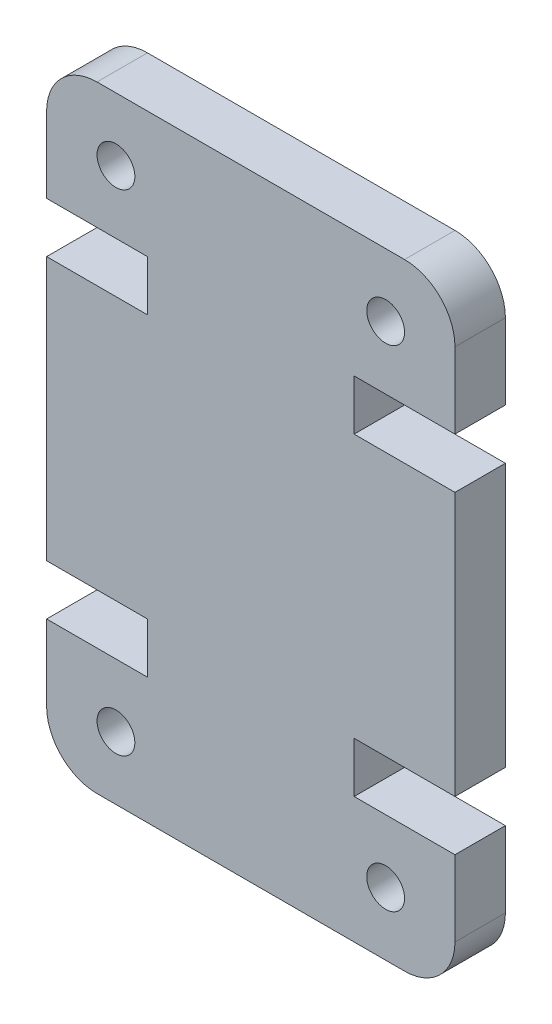
ISO-10303-21;
HEADER;
FILE_DESCRIPTION(('STEP AP214'),'2;1');
FILE_NAME('part.step','',(''),(''),'','','');
FILE_SCHEMA(('AUTOMOTIVE_DESIGN { 1 0 10303 214 1 1 1 1 }'));
ENDSEC;
DATA;
#1=APPLICATION_CONTEXT('core data for automotive mechanical design processes');
#2=APPLICATION_PROTOCOL_DEFINITION('international standard','automotive_design',2000,#1);
#3=PRODUCT_CONTEXT('',#1,'mechanical');
#4=PRODUCT('Part','Part','',(#3));
#5=PRODUCT_RELATED_PRODUCT_CATEGORY('part','',(#4));
#6=PRODUCT_DEFINITION_FORMATION('','',#4);
#7=PRODUCT_DEFINITION_CONTEXT('part definition',#1,'design');
#8=PRODUCT_DEFINITION('design','',#6,#7);
#9=PRODUCT_DEFINITION_SHAPE('','',#8);
#10=(LENGTH_UNIT() NAMED_UNIT(*) SI_UNIT(.MILLI.,.METRE.));
#11=(NAMED_UNIT(*) PLANE_ANGLE_UNIT() SI_UNIT($,.RADIAN.));
#12=(NAMED_UNIT(*) SI_UNIT($,.STERADIAN.) SOLID_ANGLE_UNIT());
#13=UNCERTAINTY_MEASURE_WITH_UNIT(LENGTH_MEASURE(1.E-05),#10,'distance_accuracy_value','');
#14=(GEOMETRIC_REPRESENTATION_CONTEXT(3) GLOBAL_UNCERTAINTY_ASSIGNED_CONTEXT((#13)) GLOBAL_UNIT_ASSIGNED_CONTEXT((#10,
#11,#12)) REPRESENTATION_CONTEXT('',''));
#15=CARTESIAN_POINT('',(0.,0.,0.));
#16=DIRECTION('',(0.,0.,1.));
#17=DIRECTION('',(1.,0.,0.));
#18=AXIS2_PLACEMENT_3D('',#15,#16,#17);
#19=CARTESIAN_POINT('',(14.2,2.,2.));
#20=DIRECTION('',(0.,0.,-1.));
#21=DIRECTION('',(-1.,0.,0.));
#22=AXIS2_PLACEMENT_3D('',#19,#20,#21);
#23=PLANE('',#22);
#24=CARTESIAN_POINT('',(2.74999999999805,21.9500000000001,2.));
#25=DIRECTION('',(0.,0.,1.));
#26=DIRECTION('',(-1.,0.,0.));
#27=AXIS2_PLACEMENT_3D('',#24,#25,#26);
#28=CIRCLE('',#27,0.750000000000028);
#29=CARTESIAN_POINT('',(1.99999999999802,21.9500000000001,2.));
#30=VERTEX_POINT('',#29);
#31=EDGE_CURVE('E448',#30,#30,#28,.T.);
#32=ORIENTED_EDGE('',*,*,#31,.F.);
#33=EDGE_LOOP('',(#32));
#34=FACE_BOUND('',#33,.T.);
#35=CARTESIAN_POINT('',(13.4500000000019,2.4999999999999,2.));
#36=DIRECTION('',(0.,0.,1.));
#37=DIRECTION('',(-1.,0.,0.));
#38=AXIS2_PLACEMENT_3D('',#35,#36,#37);
#39=CIRCLE('',#38,0.750000000000029);
#40=CARTESIAN_POINT('',(12.7000000000019,2.4999999999999,2.));
#41=VERTEX_POINT('',#40);
#42=EDGE_CURVE('E230',#41,#41,#39,.T.);
#43=ORIENTED_EDGE('',*,*,#42,.F.);
#44=EDGE_LOOP('',(#43));
#45=FACE_BOUND('',#44,.T.);
#46=CARTESIAN_POINT('',(14.2,2.,2.));
#47=DIRECTION('',(0.,0.,1.));
#48=DIRECTION('',(-1.,0.,0.));
#49=AXIS2_PLACEMENT_3D('',#46,#47,#48);
#50=CIRCLE('',#49,2.);
#51=CARTESIAN_POINT('',(14.2,0.,2.));
#52=VERTEX_POINT('',#51);
#53=CARTESIAN_POINT('',(16.2,2.,2.));
#54=VERTEX_POINT('',#53);
#55=EDGE_CURVE('E273',#52,#54,#50,.T.);
#56=ORIENTED_EDGE('',*,*,#55,.T.);
#57=DIRECTION('',(0.,1.,0.));
#58=VECTOR('',#57,1.);
#59=CARTESIAN_POINT('',(16.2,5.00000000000014,2.));
#60=LINE('',#59,#58);
#61=CARTESIAN_POINT('',(16.2,5.00000000000014,2.));
#62=VERTEX_POINT('',#61);
#63=EDGE_CURVE('E141',#54,#62,#60,.T.);
#64=ORIENTED_EDGE('',*,*,#63,.T.);
#65=DIRECTION('',(-1.,0.,0.));
#66=VECTOR('',#65,1.);
#67=CARTESIAN_POINT('',(12.2,5.00000000000014,2.));
#68=LINE('',#67,#66);
#69=CARTESIAN_POINT('',(12.2,5.00000000000014,2.));
#70=VERTEX_POINT('',#69);
#71=EDGE_CURVE('E336',#62,#70,#68,.T.);
#72=ORIENTED_EDGE('',*,*,#71,.T.);
#73=DIRECTION('',(0.,1.,0.));
#74=VECTOR('',#73,1.);
#75=CARTESIAN_POINT('',(12.2,7.00000000000014,2.));
#76=LINE('',#75,#74);
#77=CARTESIAN_POINT('',(12.2,7.00000000000014,2.));
#78=VERTEX_POINT('',#77);
#79=EDGE_CURVE('E355',#70,#78,#76,.T.);
#80=ORIENTED_EDGE('',*,*,#79,.T.);
#81=DIRECTION('',(1.,0.,0.));
#82=VECTOR('',#81,1.);
#83=CARTESIAN_POINT('',(16.2,7.00000000000014,2.));
#84=LINE('',#83,#82);
#85=CARTESIAN_POINT('',(16.2,7.00000000000014,2.));
#86=VERTEX_POINT('',#85);
#87=EDGE_CURVE('E352',#78,#86,#84,.T.);
#88=ORIENTED_EDGE('',*,*,#87,.T.);
#89=DIRECTION('',(0.,1.,0.));
#90=VECTOR('',#89,1.);
#91=CARTESIAN_POINT('',(16.2,17.4499999999999,2.));
#92=LINE('',#91,#90);
#93=CARTESIAN_POINT('',(16.2,17.4499999999999,2.));
#94=VERTEX_POINT('',#93);
#95=EDGE_CURVE('E354',#86,#94,#92,.T.);
#96=ORIENTED_EDGE('',*,*,#95,.T.);
#97=DIRECTION('',(-1.,0.,0.));
#98=VECTOR('',#97,1.);
#99=CARTESIAN_POINT('',(16.2,17.4499999999999,2.));
#100=LINE('',#99,#98);
#101=CARTESIAN_POINT('',(12.2,17.4499999999999,2.));
#102=VERTEX_POINT('',#101);
#103=EDGE_CURVE('E357',#94,#102,#100,.T.);
#104=ORIENTED_EDGE('',*,*,#103,.T.);
#105=DIRECTION('',(0.,1.,0.));
#106=VECTOR('',#105,1.);
#107=CARTESIAN_POINT('',(12.2,17.4499999999999,2.));
#108=LINE('',#107,#106);
#109=CARTESIAN_POINT('',(12.2,19.4499999999999,2.));
#110=VERTEX_POINT('',#109);
#111=EDGE_CURVE('E363',#102,#110,#108,.T.);
#112=ORIENTED_EDGE('',*,*,#111,.T.);
#113=DIRECTION('',(1.,0.,0.));
#114=VECTOR('',#113,1.);
#115=CARTESIAN_POINT('',(12.2,19.4499999999999,2.));
#116=LINE('',#115,#114);
#117=CARTESIAN_POINT('',(16.2,19.4499999999999,2.));
#118=VERTEX_POINT('',#117);
#119=EDGE_CURVE('E365',#110,#118,#116,.T.);
#120=ORIENTED_EDGE('',*,*,#119,.T.);
#121=DIRECTION('',(0.,1.,0.));
#122=VECTOR('',#121,1.);
#123=CARTESIAN_POINT('',(16.2,19.4499999999999,2.));
#124=LINE('',#123,#122);
#125=CARTESIAN_POINT('',(16.2,22.45,2.));
#126=VERTEX_POINT('',#125);
#127=EDGE_CURVE('E367',#118,#126,#124,.T.);
#128=ORIENTED_EDGE('',*,*,#127,.T.);
#129=CARTESIAN_POINT('',(14.2,22.45,2.));
#130=DIRECTION('',(0.,0.,1.));
#131=DIRECTION('',(1.,0.,0.));
#132=AXIS2_PLACEMENT_3D('',#129,#130,#131);
#133=CIRCLE('',#132,2.);
#134=CARTESIAN_POINT('',(14.2,24.45,2.));
#135=VERTEX_POINT('',#134);
#136=EDGE_CURVE('E369',#126,#135,#133,.T.);
#137=ORIENTED_EDGE('',*,*,#136,.T.);
#138=DIRECTION('',(-1.,0.,0.));
#139=VECTOR('',#138,1.);
#140=CARTESIAN_POINT('',(1.99999999999999,24.45,2.));
#141=LINE('',#140,#139);
#142=CARTESIAN_POINT('',(1.99999999999999,24.45,2.));
#143=VERTEX_POINT('',#142);
#144=EDGE_CURVE('E371',#135,#143,#141,.T.);
#145=ORIENTED_EDGE('',*,*,#144,.T.);
#146=CARTESIAN_POINT('',(2.,22.45,2.));
#147=DIRECTION('',(0.,0.,1.));
#148=DIRECTION('',(-1.,0.,0.));
#149=AXIS2_PLACEMENT_3D('',#146,#147,#148);
#150=CIRCLE('',#149,2.);
#151=CARTESIAN_POINT('',(0.,22.45,2.));
#152=VERTEX_POINT('',#151);
#153=EDGE_CURVE('E373',#143,#152,#150,.T.);
#154=ORIENTED_EDGE('',*,*,#153,.T.);
#155=DIRECTION('',(0.,-1.,0.));
#156=VECTOR('',#155,1.);
#157=CARTESIAN_POINT('',(0.,19.4499999999999,2.));
#158=LINE('',#157,#156);
#159=CARTESIAN_POINT('',(0.,19.4499999999999,2.));
#160=VERTEX_POINT('',#159);
#161=EDGE_CURVE('E375',#152,#160,#158,.T.);
#162=ORIENTED_EDGE('',*,*,#161,.T.);
#163=DIRECTION('',(1.,0.,0.));
#164=VECTOR('',#163,1.);
#165=CARTESIAN_POINT('',(3.99999999999999,19.4499999999999,2.));
#166=LINE('',#165,#164);
#167=CARTESIAN_POINT('',(3.99999999999999,19.4499999999999,2.));
#168=VERTEX_POINT('',#167);
#169=EDGE_CURVE('E377',#160,#168,#166,.T.);
#170=ORIENTED_EDGE('',*,*,#169,.T.);
#171=DIRECTION('',(0.,-1.,0.));
#172=VECTOR('',#171,1.);
#173=CARTESIAN_POINT('',(3.99999999999999,17.4499999999999,2.));
#174=LINE('',#173,#172);
#175=CARTESIAN_POINT('',(3.99999999999999,17.4499999999999,2.));
#176=VERTEX_POINT('',#175);
#177=EDGE_CURVE('E379',#168,#176,#174,.T.);
#178=ORIENTED_EDGE('',*,*,#177,.T.);
#179=DIRECTION('',(-1.,0.,0.));
#180=VECTOR('',#179,1.);
#181=CARTESIAN_POINT('',(0.,17.4499999999999,2.));
#182=LINE('',#181,#180);
#183=CARTESIAN_POINT('',(0.,17.4499999999999,2.));
#184=VERTEX_POINT('',#183);
#185=EDGE_CURVE('E381',#176,#184,#182,.T.);
#186=ORIENTED_EDGE('',*,*,#185,.T.);
#187=DIRECTION('',(0.,-1.,0.));
#188=VECTOR('',#187,1.);
#189=CARTESIAN_POINT('',(0.,17.4499999999999,2.));
#190=LINE('',#189,#188);
#191=CARTESIAN_POINT('',(0.,7.00000000000012,2.));
#192=VERTEX_POINT('',#191);
#193=EDGE_CURVE('E383',#184,#192,#190,.T.);
#194=ORIENTED_EDGE('',*,*,#193,.T.);
#195=DIRECTION('',(1.,0.,0.));
#196=VECTOR('',#195,1.);
#197=CARTESIAN_POINT('',(0.,7.00000000000012,2.));
#198=LINE('',#197,#196);
#199=CARTESIAN_POINT('',(4.,7.00000000000014,2.));
#200=VERTEX_POINT('',#199);
#201=EDGE_CURVE('E385',#192,#200,#198,.T.);
#202=ORIENTED_EDGE('',*,*,#201,.T.);
#203=DIRECTION('',(0.,-1.,0.));
#204=VECTOR('',#203,1.);
#205=CARTESIAN_POINT('',(4.,7.00000000000014,2.));
#206=LINE('',#205,#204);
#207=CARTESIAN_POINT('',(4.,5.00000000000014,2.));
#208=VERTEX_POINT('',#207);
#209=EDGE_CURVE('E387',#200,#208,#206,.T.);
#210=ORIENTED_EDGE('',*,*,#209,.T.);
#211=DIRECTION('',(-1.,0.,0.));
#212=VECTOR('',#211,1.);
#213=CARTESIAN_POINT('',(4.,5.00000000000014,2.));
#214=LINE('',#213,#212);
#215=CARTESIAN_POINT('',(0.,5.00000000000014,2.));
#216=VERTEX_POINT('',#215);
#217=EDGE_CURVE('E208',#208,#216,#214,.T.);
#218=ORIENTED_EDGE('',*,*,#217,.T.);
#219=DIRECTION('',(0.,-1.,0.));
#220=VECTOR('',#219,1.);
#221=CARTESIAN_POINT('',(0.,5.00000000000014,2.));
#222=LINE('',#221,#220);
#223=CARTESIAN_POINT('',(0.,2.00000000000002,2.));
#224=VERTEX_POINT('',#223);
#225=EDGE_CURVE('E202',#216,#224,#222,.T.);
#226=ORIENTED_EDGE('',*,*,#225,.T.);
#227=CARTESIAN_POINT('',(2.,2.,2.));
#228=DIRECTION('',(0.,0.,1.));
#229=DIRECTION('',(1.,0.,0.));
#230=AXIS2_PLACEMENT_3D('',#227,#228,#229);
#231=CIRCLE('',#230,2.);
#232=CARTESIAN_POINT('',(2.,0.,2.));
#233=VERTEX_POINT('',#232);
#234=EDGE_CURVE('E206',#224,#233,#231,.T.);
#235=ORIENTED_EDGE('',*,*,#234,.T.);
#236=DIRECTION('',(1.,0.,0.));
#237=VECTOR('',#236,1.);
#238=CARTESIAN_POINT('',(2.,0.,2.));
#239=LINE('',#238,#237);
#240=EDGE_CURVE('E50',#233,#52,#239,.T.);
#241=ORIENTED_EDGE('',*,*,#240,.T.);
#242=EDGE_LOOP('',(#56,#64,#72,#80,#88,#96,#104,#112,#120,#128,#137,#145,#154,#162,#170,#178,
#186,#194,#202,#210,#218,#226,#235,#241));
#243=FACE_BOUND('',#242,.T.);
#244=CARTESIAN_POINT('',(2.74999999999805,2.4999999999999,2.));
#245=DIRECTION('',(0.,0.,1.));
#246=DIRECTION('',(1.,0.,0.));
#247=AXIS2_PLACEMENT_3D('',#244,#245,#246);
#248=CIRCLE('',#247,0.750000000000028);
#249=CARTESIAN_POINT('',(3.49999999999808,2.4999999999999,2.));
#250=VERTEX_POINT('',#249);
#251=EDGE_CURVE('E454',#250,#250,#248,.T.);
#252=ORIENTED_EDGE('',*,*,#251,.F.);
#253=EDGE_LOOP('',(#252));
#254=FACE_BOUND('',#253,.T.);
#255=CARTESIAN_POINT('',(13.4500000000019,21.9500000000001,2.));
#256=DIRECTION('',(0.,0.,1.));
#257=DIRECTION('',(1.,0.,0.));
#258=AXIS2_PLACEMENT_3D('',#255,#256,#257);
#259=CIRCLE('',#258,0.750000000000024);
#260=CARTESIAN_POINT('',(14.200000000002,21.9500000000001,2.));
#261=VERTEX_POINT('',#260);
#262=EDGE_CURVE('E439',#261,#261,#259,.T.);
#263=ORIENTED_EDGE('',*,*,#262,.F.);
#264=EDGE_LOOP('',(#263));
#265=FACE_BOUND('',#264,.T.);
#266=ADVANCED_FACE('F33',(#34,#45,#243,#254,#265),#23,.F.);
#267=CARTESIAN_POINT('',(14.2,2.,0.));
#268=DIRECTION('',(0.,0.,-1.));
#269=DIRECTION('',(-1.,0.,0.));
#270=AXIS2_PLACEMENT_3D('',#267,#268,#269);
#271=PLANE('',#270);
#272=CARTESIAN_POINT('',(2.74999999999805,21.9500000000001,0.));
#273=DIRECTION('',(0.,0.,1.));
#274=DIRECTION('',(-1.,0.,0.));
#275=AXIS2_PLACEMENT_3D('',#272,#273,#274);
#276=CIRCLE('',#275,0.750000000000028);
#277=CARTESIAN_POINT('',(1.99999999999802,21.9500000000001,0.));
#278=VERTEX_POINT('',#277);
#279=EDGE_CURVE('E445',#278,#278,#276,.T.);
#280=ORIENTED_EDGE('',*,*,#279,.T.);
#281=EDGE_LOOP('',(#280));
#282=FACE_BOUND('',#281,.T.);
#283=CARTESIAN_POINT('',(13.4500000000019,2.4999999999999,0.));
#284=DIRECTION('',(0.,0.,1.));
#285=DIRECTION('',(-1.,0.,0.));
#286=AXIS2_PLACEMENT_3D('',#283,#284,#285);
#287=CIRCLE('',#286,0.750000000000029);
#288=CARTESIAN_POINT('',(12.7000000000019,2.4999999999999,0.));
#289=VERTEX_POINT('',#288);
#290=EDGE_CURVE('E457',#289,#289,#287,.T.);
#291=ORIENTED_EDGE('',*,*,#290,.T.);
#292=EDGE_LOOP('',(#291));
#293=FACE_BOUND('',#292,.T.);
#294=CARTESIAN_POINT('',(14.2,2.,0.));
#295=DIRECTION('',(0.,0.,1.));
#296=DIRECTION('',(-1.,0.,0.));
#297=AXIS2_PLACEMENT_3D('',#294,#295,#296);
#298=CIRCLE('',#297,2.);
#299=CARTESIAN_POINT('',(14.2,0.,0.));
#300=VERTEX_POINT('',#299);
#301=CARTESIAN_POINT('',(16.2,2.,0.));
#302=VERTEX_POINT('',#301);
#303=EDGE_CURVE('E226',#300,#302,#298,.T.);
#304=ORIENTED_EDGE('',*,*,#303,.F.);
#305=DIRECTION('',(1.,0.,0.));
#306=VECTOR('',#305,1.);
#307=CARTESIAN_POINT('',(2.,0.,0.));
#308=LINE('',#307,#306);
#309=CARTESIAN_POINT('',(2.,0.,0.));
#310=VERTEX_POINT('',#309);
#311=EDGE_CURVE('E133',#310,#300,#308,.T.);
#312=ORIENTED_EDGE('',*,*,#311,.F.);
#313=CARTESIAN_POINT('',(2.,2.,0.));
#314=DIRECTION('',(0.,0.,1.));
#315=DIRECTION('',(1.,0.,0.));
#316=AXIS2_PLACEMENT_3D('',#313,#314,#315);
#317=CIRCLE('',#316,2.);
#318=CARTESIAN_POINT('',(0.,2.00000000000002,0.));
#319=VERTEX_POINT('',#318);
#320=EDGE_CURVE('E127',#319,#310,#317,.T.);
#321=ORIENTED_EDGE('',*,*,#320,.F.);
#322=DIRECTION('',(0.,-1.,0.));
#323=VECTOR('',#322,1.);
#324=CARTESIAN_POINT('',(0.,5.00000000000014,0.));
#325=LINE('',#324,#323);
#326=CARTESIAN_POINT('',(0.,5.00000000000014,0.));
#327=VERTEX_POINT('',#326);
#328=EDGE_CURVE('E216',#327,#319,#325,.T.);
#329=ORIENTED_EDGE('',*,*,#328,.F.);
#330=DIRECTION('',(-1.,0.,0.));
#331=VECTOR('',#330,1.);
#332=CARTESIAN_POINT('',(4.,5.00000000000014,0.));
#333=LINE('',#332,#331);
#334=CARTESIAN_POINT('',(4.,5.00000000000014,0.));
#335=VERTEX_POINT('',#334);
#336=EDGE_CURVE('E268',#335,#327,#333,.T.);
#337=ORIENTED_EDGE('',*,*,#336,.F.);
#338=DIRECTION('',(0.,-1.,0.));
#339=VECTOR('',#338,1.);
#340=CARTESIAN_POINT('',(4.,7.00000000000014,0.));
#341=LINE('',#340,#339);
#342=CARTESIAN_POINT('',(4.,7.00000000000014,0.));
#343=VERTEX_POINT('',#342);
#344=EDGE_CURVE('E266',#343,#335,#341,.T.);
#345=ORIENTED_EDGE('',*,*,#344,.F.);
#346=DIRECTION('',(1.,0.,0.));
#347=VECTOR('',#346,1.);
#348=CARTESIAN_POINT('',(0.,7.00000000000012,0.));
#349=LINE('',#348,#347);
#350=CARTESIAN_POINT('',(0.,7.00000000000012,0.));
#351=VERTEX_POINT('',#350);
#352=EDGE_CURVE('E264',#351,#343,#349,.T.);
#353=ORIENTED_EDGE('',*,*,#352,.F.);
#354=DIRECTION('',(0.,-1.,0.));
#355=VECTOR('',#354,1.);
#356=CARTESIAN_POINT('',(0.,17.4499999999999,0.));
#357=LINE('',#356,#355);
#358=CARTESIAN_POINT('',(0.,17.4499999999999,0.));
#359=VERTEX_POINT('',#358);
#360=EDGE_CURVE('E262',#359,#351,#357,.T.);
#361=ORIENTED_EDGE('',*,*,#360,.F.);
#362=DIRECTION('',(-1.,0.,0.));
#363=VECTOR('',#362,1.);
#364=CARTESIAN_POINT('',(0.,17.4499999999999,0.));
#365=LINE('',#364,#363);
#366=CARTESIAN_POINT('',(3.99999999999999,17.4499999999999,0.));
#367=VERTEX_POINT('',#366);
#368=EDGE_CURVE('E260',#367,#359,#365,.T.);
#369=ORIENTED_EDGE('',*,*,#368,.F.);
#370=DIRECTION('',(0.,-1.,0.));
#371=VECTOR('',#370,1.);
#372=CARTESIAN_POINT('',(3.99999999999999,17.4499999999999,0.));
#373=LINE('',#372,#371);
#374=CARTESIAN_POINT('',(3.99999999999999,19.4499999999999,0.));
#375=VERTEX_POINT('',#374);
#376=EDGE_CURVE('E258',#375,#367,#373,.T.);
#377=ORIENTED_EDGE('',*,*,#376,.F.);
#378=DIRECTION('',(1.,0.,0.));
#379=VECTOR('',#378,1.);
#380=CARTESIAN_POINT('',(3.99999999999999,19.4499999999999,0.));
#381=LINE('',#380,#379);
#382=CARTESIAN_POINT('',(0.,19.4499999999999,0.));
#383=VERTEX_POINT('',#382);
#384=EDGE_CURVE('E256',#383,#375,#381,.T.);
#385=ORIENTED_EDGE('',*,*,#384,.F.);
#386=DIRECTION('',(0.,-1.,0.));
#387=VECTOR('',#386,1.);
#388=CARTESIAN_POINT('',(0.,19.4499999999999,0.));
#389=LINE('',#388,#387);
#390=CARTESIAN_POINT('',(0.,22.45,0.));
#391=VERTEX_POINT('',#390);
#392=EDGE_CURVE('E254',#391,#383,#389,.T.);
#393=ORIENTED_EDGE('',*,*,#392,.F.);
#394=CARTESIAN_POINT('',(2.,22.45,0.));
#395=DIRECTION('',(0.,0.,1.));
#396=DIRECTION('',(-1.,0.,0.));
#397=AXIS2_PLACEMENT_3D('',#394,#395,#396);
#398=CIRCLE('',#397,2.);
#399=CARTESIAN_POINT('',(1.99999999999999,24.45,0.));
#400=VERTEX_POINT('',#399);
#401=EDGE_CURVE('E252',#400,#391,#398,.T.);
#402=ORIENTED_EDGE('',*,*,#401,.F.);
#403=DIRECTION('',(-1.,0.,0.));
#404=VECTOR('',#403,1.);
#405=CARTESIAN_POINT('',(1.99999999999999,24.45,0.));
#406=LINE('',#405,#404);
#407=CARTESIAN_POINT('',(14.2,24.45,0.));
#408=VERTEX_POINT('',#407);
#409=EDGE_CURVE('E250',#408,#400,#406,.T.);
#410=ORIENTED_EDGE('',*,*,#409,.F.);
#411=CARTESIAN_POINT('',(14.2,22.45,0.));
#412=DIRECTION('',(0.,0.,1.));
#413=DIRECTION('',(1.,0.,0.));
#414=AXIS2_PLACEMENT_3D('',#411,#412,#413);
#415=CIRCLE('',#414,2.);
#416=CARTESIAN_POINT('',(16.2,22.45,0.));
#417=VERTEX_POINT('',#416);
#418=EDGE_CURVE('E248',#417,#408,#415,.T.);
#419=ORIENTED_EDGE('',*,*,#418,.F.);
#420=DIRECTION('',(0.,1.,0.));
#421=VECTOR('',#420,1.);
#422=CARTESIAN_POINT('',(16.2,19.4499999999999,0.));
#423=LINE('',#422,#421);
#424=CARTESIAN_POINT('',(16.2,19.4499999999999,0.));
#425=VERTEX_POINT('',#424);
#426=EDGE_CURVE('E246',#425,#417,#423,.T.);
#427=ORIENTED_EDGE('',*,*,#426,.F.);
#428=DIRECTION('',(1.,0.,0.));
#429=VECTOR('',#428,1.);
#430=CARTESIAN_POINT('',(12.2,19.4499999999999,0.));
#431=LINE('',#430,#429);
#432=CARTESIAN_POINT('',(12.2,19.4499999999999,0.));
#433=VERTEX_POINT('',#432);
#434=EDGE_CURVE('E244',#433,#425,#431,.T.);
#435=ORIENTED_EDGE('',*,*,#434,.F.);
#436=DIRECTION('',(0.,1.,0.));
#437=VECTOR('',#436,1.);
#438=CARTESIAN_POINT('',(12.2,17.4499999999999,0.));
#439=LINE('',#438,#437);
#440=CARTESIAN_POINT('',(12.2,17.4499999999999,0.));
#441=VERTEX_POINT('',#440);
#442=EDGE_CURVE('E242',#441,#433,#439,.T.);
#443=ORIENTED_EDGE('',*,*,#442,.F.);
#444=DIRECTION('',(-1.,0.,0.));
#445=VECTOR('',#444,1.);
#446=CARTESIAN_POINT('',(16.2,17.4499999999999,0.));
#447=LINE('',#446,#445);
#448=CARTESIAN_POINT('',(16.2,17.4499999999999,0.));
#449=VERTEX_POINT('',#448);
#450=EDGE_CURVE('E240',#449,#441,#447,.T.);
#451=ORIENTED_EDGE('',*,*,#450,.F.);
#452=DIRECTION('',(0.,1.,0.));
#453=VECTOR('',#452,1.);
#454=CARTESIAN_POINT('',(16.2,17.4499999999999,0.));
#455=LINE('',#454,#453);
#456=CARTESIAN_POINT('',(16.2,7.00000000000014,0.));
#457=VERTEX_POINT('',#456);
#458=EDGE_CURVE('E238',#457,#449,#455,.T.);
#459=ORIENTED_EDGE('',*,*,#458,.F.);
#460=DIRECTION('',(1.,0.,0.));
#461=VECTOR('',#460,1.);
#462=CARTESIAN_POINT('',(16.2,7.00000000000014,0.));
#463=LINE('',#462,#461);
#464=CARTESIAN_POINT('',(12.2,7.00000000000014,0.));
#465=VERTEX_POINT('',#464);
#466=EDGE_CURVE('E236',#465,#457,#463,.T.);
#467=ORIENTED_EDGE('',*,*,#466,.F.);
#468=DIRECTION('',(0.,1.,0.));
#469=VECTOR('',#468,1.);
#470=CARTESIAN_POINT('',(12.2,7.00000000000014,0.));
#471=LINE('',#470,#469);
#472=CARTESIAN_POINT('',(12.2,5.00000000000014,0.));
#473=VERTEX_POINT('',#472);
#474=EDGE_CURVE('E234',#473,#465,#471,.T.);
#475=ORIENTED_EDGE('',*,*,#474,.F.);
#476=DIRECTION('',(-1.,0.,0.));
#477=VECTOR('',#476,1.);
#478=CARTESIAN_POINT('',(12.2,5.00000000000014,0.));
#479=LINE('',#478,#477);
#480=CARTESIAN_POINT('',(16.2,5.00000000000014,0.));
#481=VERTEX_POINT('',#480);
#482=EDGE_CURVE('E232',#481,#473,#479,.T.);
#483=ORIENTED_EDGE('',*,*,#482,.F.);
#484=DIRECTION('',(0.,1.,0.));
#485=VECTOR('',#484,1.);
#486=CARTESIAN_POINT('',(16.2,5.00000000000014,0.));
#487=LINE('',#486,#485);
#488=EDGE_CURVE('E229',#302,#481,#487,.T.);
#489=ORIENTED_EDGE('',*,*,#488,.F.);
#490=EDGE_LOOP('',(#304,#312,#321,#329,#337,#345,#353,#361,#369,#377,#385,#393,#402,#410,#419,
#427,#435,#443,#451,#459,#467,#475,#483,#489));
#491=FACE_BOUND('',#490,.T.);
#492=CARTESIAN_POINT('',(2.74999999999805,2.4999999999999,0.));
#493=DIRECTION('',(0.,0.,1.));
#494=DIRECTION('',(1.,0.,0.));
#495=AXIS2_PLACEMENT_3D('',#492,#493,#494);
#496=CIRCLE('',#495,0.750000000000028);
#497=CARTESIAN_POINT('',(3.49999999999808,2.4999999999999,0.));
#498=VERTEX_POINT('',#497);
#499=EDGE_CURVE('E451',#498,#498,#496,.T.);
#500=ORIENTED_EDGE('',*,*,#499,.T.);
#501=EDGE_LOOP('',(#500));
#502=FACE_BOUND('',#501,.T.);
#503=CARTESIAN_POINT('',(13.4500000000019,21.9500000000001,0.));
#504=DIRECTION('',(0.,0.,1.));
#505=DIRECTION('',(1.,0.,0.));
#506=AXIS2_PLACEMENT_3D('',#503,#504,#505);
#507=CIRCLE('',#506,0.750000000000024);
#508=CARTESIAN_POINT('',(14.200000000002,21.9500000000001,0.));
#509=VERTEX_POINT('',#508);
#510=EDGE_CURVE('E442',#509,#509,#507,.T.);
#511=ORIENTED_EDGE('',*,*,#510,.T.);
#512=EDGE_LOOP('',(#511));
#513=FACE_BOUND('',#512,.T.);
#514=ADVANCED_FACE('F340',(#282,#293,#491,#502,#513),#271,.T.);
#515=CARTESIAN_POINT('',(14.2,2.,2.));
#516=DIRECTION('',(0.,0.,-1.));
#517=DIRECTION('',(-1.,0.,0.));
#518=AXIS2_PLACEMENT_3D('',#515,#516,#517);
#519=CYLINDRICAL_SURFACE('',#518,2.);
#520=ORIENTED_EDGE('',*,*,#303,.T.);
#521=DIRECTION('',(0.,0.,-1.));
#522=VECTOR('',#521,1.);
#523=CARTESIAN_POINT('',(16.2,2.,2.));
#524=LINE('',#523,#522);
#525=EDGE_CURVE('E11',#54,#302,#524,.T.);
#526=ORIENTED_EDGE('',*,*,#525,.F.);
#527=ORIENTED_EDGE('',*,*,#55,.F.);
#528=DIRECTION('',(0.,0.,-1.));
#529=VECTOR('',#528,1.);
#530=CARTESIAN_POINT('',(14.2,0.,2.));
#531=LINE('',#530,#529);
#532=EDGE_CURVE('E222',#52,#300,#531,.T.);
#533=ORIENTED_EDGE('',*,*,#532,.T.);
#534=EDGE_LOOP('',(#520,#526,#527,#533));
#535=FACE_BOUND('',#534,.T.);
#536=ADVANCED_FACE('F35',(#535),#519,.T.);
#537=CARTESIAN_POINT('',(16.2,5.00000000000014,2.));
#538=DIRECTION('',(-1.,0.,0.));
#539=DIRECTION('',(0.,0.,1.));
#540=AXIS2_PLACEMENT_3D('',#537,#538,#539);
#541=PLANE('',#540);
#542=ORIENTED_EDGE('',*,*,#488,.T.);
#543=DIRECTION('',(0.,0.,-1.));
#544=VECTOR('',#543,1.);
#545=CARTESIAN_POINT('',(16.2,5.00000000000014,2.));
#546=LINE('',#545,#544);
#547=EDGE_CURVE('E42',#62,#481,#546,.T.);
#548=ORIENTED_EDGE('',*,*,#547,.F.);
#549=ORIENTED_EDGE('',*,*,#63,.F.);
#550=ORIENTED_EDGE('',*,*,#525,.T.);
#551=EDGE_LOOP('',(#542,#548,#549,#550));
#552=FACE_BOUND('',#551,.T.);
#553=ADVANCED_FACE('F686',(#552),#541,.F.);
#554=CARTESIAN_POINT('',(12.2,5.00000000000014,2.));
#555=DIRECTION('',(0.,-1.,0.));
#556=DIRECTION('',(0.,0.,-1.));
#557=AXIS2_PLACEMENT_3D('',#554,#555,#556);
#558=PLANE('',#557);
#559=ORIENTED_EDGE('',*,*,#482,.T.);
#560=DIRECTION('',(0.,0.,-1.));
#561=VECTOR('',#560,1.);
#562=CARTESIAN_POINT('',(12.2,5.00000000000014,2.));
#563=LINE('',#562,#561);
#564=EDGE_CURVE('E328',#70,#473,#563,.T.);
#565=ORIENTED_EDGE('',*,*,#564,.F.);
#566=ORIENTED_EDGE('',*,*,#71,.F.);
#567=ORIENTED_EDGE('',*,*,#547,.T.);
#568=EDGE_LOOP('',(#559,#565,#566,#567));
#569=FACE_BOUND('',#568,.T.);
#570=ADVANCED_FACE('F334',(#569),#558,.F.);
#571=CARTESIAN_POINT('',(12.2,7.00000000000014,2.));
#572=DIRECTION('',(-1.,0.,0.));
#573=DIRECTION('',(0.,0.,1.));
#574=AXIS2_PLACEMENT_3D('',#571,#572,#573);
#575=PLANE('',#574);
#576=ORIENTED_EDGE('',*,*,#474,.T.);
#577=DIRECTION('',(0.,0.,-1.));
#578=VECTOR('',#577,1.);
#579=CARTESIAN_POINT('',(12.2,7.00000000000014,2.));
#580=LINE('',#579,#578);
#581=EDGE_CURVE('E325',#78,#465,#580,.T.);
#582=ORIENTED_EDGE('',*,*,#581,.F.);
#583=ORIENTED_EDGE('',*,*,#79,.F.);
#584=ORIENTED_EDGE('',*,*,#564,.T.);
#585=EDGE_LOOP('',(#576,#582,#583,#584));
#586=FACE_BOUND('',#585,.T.);
#587=ADVANCED_FACE('F346',(#586),#575,.F.);
#588=CARTESIAN_POINT('',(16.2,7.00000000000014,2.));
#589=DIRECTION('',(0.,1.,0.));
#590=DIRECTION('',(-1.,0.,0.));
#591=AXIS2_PLACEMENT_3D('',#588,#589,#590);
#592=PLANE('',#591);
#593=ORIENTED_EDGE('',*,*,#466,.T.);
#594=DIRECTION('',(0.,0.,-1.));
#595=VECTOR('',#594,1.);
#596=CARTESIAN_POINT('',(16.2,7.00000000000014,2.));
#597=LINE('',#596,#595);
#598=EDGE_CURVE('E322',#86,#457,#597,.T.);
#599=ORIENTED_EDGE('',*,*,#598,.F.);
#600=ORIENTED_EDGE('',*,*,#87,.F.);
#601=ORIENTED_EDGE('',*,*,#581,.T.);
#602=EDGE_LOOP('',(#593,#599,#600,#601));
#603=FACE_BOUND('',#602,.T.);
#604=ADVANCED_FACE('F350',(#603),#592,.F.);
#605=CARTESIAN_POINT('',(16.2,17.4499999999999,2.));
#606=DIRECTION('',(-1.,0.,0.));
#607=DIRECTION('',(0.,0.,1.));
#608=AXIS2_PLACEMENT_3D('',#605,#606,#607);
#609=PLANE('',#608);
#610=ORIENTED_EDGE('',*,*,#458,.T.);
#611=DIRECTION('',(0.,0.,-1.));
#612=VECTOR('',#611,1.);
#613=CARTESIAN_POINT('',(16.2,17.4499999999999,2.));
#614=LINE('',#613,#612);
#615=EDGE_CURVE('E319',#94,#449,#614,.T.);
#616=ORIENTED_EDGE('',*,*,#615,.F.);
#617=ORIENTED_EDGE('',*,*,#95,.F.);
#618=ORIENTED_EDGE('',*,*,#598,.T.);
#619=EDGE_LOOP('',(#610,#616,#617,#618));
#620=FACE_BOUND('',#619,.T.);
#621=ADVANCED_FACE('F651',(#620),#609,.F.);
#622=CARTESIAN_POINT('',(16.2,17.4499999999999,2.));
#623=DIRECTION('',(0.,-1.,0.));
#624=DIRECTION('',(1.,0.,0.));
#625=AXIS2_PLACEMENT_3D('',#622,#623,#624);
#626=PLANE('',#625);
#627=ORIENTED_EDGE('',*,*,#450,.T.);
#628=DIRECTION('',(0.,0.,-1.));
#629=VECTOR('',#628,1.);
#630=CARTESIAN_POINT('',(12.2,17.4499999999999,2.));
#631=LINE('',#630,#629);
#632=EDGE_CURVE('E316',#102,#441,#631,.T.);
#633=ORIENTED_EDGE('',*,*,#632,.F.);
#634=ORIENTED_EDGE('',*,*,#103,.F.);
#635=ORIENTED_EDGE('',*,*,#615,.T.);
#636=EDGE_LOOP('',(#627,#633,#634,#635));
#637=FACE_BOUND('',#636,.T.);
#638=ADVANCED_FACE('F641',(#637),#626,.F.);
#639=CARTESIAN_POINT('',(12.2,17.4499999999999,2.));
#640=DIRECTION('',(-1.,0.,0.));
#641=DIRECTION('',(0.,0.,1.));
#642=AXIS2_PLACEMENT_3D('',#639,#640,#641);
#643=PLANE('',#642);
#644=ORIENTED_EDGE('',*,*,#442,.T.);
#645=DIRECTION('',(0.,0.,-1.));
#646=VECTOR('',#645,1.);
#647=CARTESIAN_POINT('',(12.2,19.4499999999999,2.));
#648=LINE('',#647,#646);
#649=EDGE_CURVE('E313',#110,#433,#648,.T.);
#650=ORIENTED_EDGE('',*,*,#649,.F.);
#651=ORIENTED_EDGE('',*,*,#111,.F.);
#652=ORIENTED_EDGE('',*,*,#632,.T.);
#653=EDGE_LOOP('',(#644,#650,#651,#652));
#654=FACE_BOUND('',#653,.T.);
#655=ADVANCED_FACE('F631',(#654),#643,.F.);
#656=CARTESIAN_POINT('',(12.2,19.4499999999999,2.));
#657=DIRECTION('',(0.,1.,0.));
#658=DIRECTION('',(0.,0.,1.));
#659=AXIS2_PLACEMENT_3D('',#656,#657,#658);
#660=PLANE('',#659);
#661=ORIENTED_EDGE('',*,*,#434,.T.);
#662=DIRECTION('',(0.,0.,-1.));
#663=VECTOR('',#662,1.);
#664=CARTESIAN_POINT('',(16.2,19.4499999999999,2.));
#665=LINE('',#664,#663);
#666=EDGE_CURVE('E310',#118,#425,#665,.T.);
#667=ORIENTED_EDGE('',*,*,#666,.F.);
#668=ORIENTED_EDGE('',*,*,#119,.F.);
#669=ORIENTED_EDGE('',*,*,#649,.T.);
#670=EDGE_LOOP('',(#661,#667,#668,#669));
#671=FACE_BOUND('',#670,.T.);
#672=ADVANCED_FACE('F621',(#671),#660,.F.);
#673=CARTESIAN_POINT('',(16.2,19.4499999999999,2.));
#674=DIRECTION('',(-1.,0.,0.));
#675=DIRECTION('',(0.,0.,1.));
#676=AXIS2_PLACEMENT_3D('',#673,#674,#675);
#677=PLANE('',#676);
#678=ORIENTED_EDGE('',*,*,#426,.T.);
#679=DIRECTION('',(0.,0.,-1.));
#680=VECTOR('',#679,1.);
#681=CARTESIAN_POINT('',(16.2,22.45,2.));
#682=LINE('',#681,#680);
#683=EDGE_CURVE('E307',#126,#417,#682,.T.);
#684=ORIENTED_EDGE('',*,*,#683,.F.);
#685=ORIENTED_EDGE('',*,*,#127,.F.);
#686=ORIENTED_EDGE('',*,*,#666,.T.);
#687=EDGE_LOOP('',(#678,#684,#685,#686));
#688=FACE_BOUND('',#687,.T.);
#689=ADVANCED_FACE('F611',(#688),#677,.F.);
#690=CARTESIAN_POINT('',(14.2,22.45,2.));
#691=DIRECTION('',(0.,0.,-1.));
#692=DIRECTION('',(-1.,0.,0.));
#693=AXIS2_PLACEMENT_3D('',#690,#691,#692);
#694=CYLINDRICAL_SURFACE('',#693,2.);
#695=ORIENTED_EDGE('',*,*,#418,.T.);
#696=DIRECTION('',(0.,0.,-1.));
#697=VECTOR('',#696,1.);
#698=CARTESIAN_POINT('',(14.2,24.45,2.));
#699=LINE('',#698,#697);
#700=EDGE_CURVE('E304',#135,#408,#699,.T.);
#701=ORIENTED_EDGE('',*,*,#700,.F.);
#702=ORIENTED_EDGE('',*,*,#136,.F.);
#703=ORIENTED_EDGE('',*,*,#683,.T.);
#704=EDGE_LOOP('',(#695,#701,#702,#703));
#705=FACE_BOUND('',#704,.T.);
#706=ADVANCED_FACE('F601',(#705),#694,.T.);
#707=CARTESIAN_POINT('',(1.99999999999999,24.45,2.));
#708=DIRECTION('',(0.,-1.,0.));
#709=DIRECTION('',(0.,0.,-1.));
#710=AXIS2_PLACEMENT_3D('',#707,#708,#709);
#711=PLANE('',#710);
#712=ORIENTED_EDGE('',*,*,#409,.T.);
#713=DIRECTION('',(0.,0.,-1.));
#714=VECTOR('',#713,1.);
#715=CARTESIAN_POINT('',(1.99999999999999,24.45,2.));
#716=LINE('',#715,#714);
#717=EDGE_CURVE('E301',#143,#400,#716,.T.);
#718=ORIENTED_EDGE('',*,*,#717,.F.);
#719=ORIENTED_EDGE('',*,*,#144,.F.);
#720=ORIENTED_EDGE('',*,*,#700,.T.);
#721=EDGE_LOOP('',(#712,#718,#719,#720));
#722=FACE_BOUND('',#721,.T.);
#723=ADVANCED_FACE('F591',(#722),#711,.F.);
#724=CARTESIAN_POINT('',(2.,22.45,2.));
#725=DIRECTION('',(0.,0.,-1.));
#726=DIRECTION('',(-1.,0.,0.));
#727=AXIS2_PLACEMENT_3D('',#724,#725,#726);
#728=CYLINDRICAL_SURFACE('',#727,2.);
#729=ORIENTED_EDGE('',*,*,#401,.T.);
#730=DIRECTION('',(0.,0.,-1.));
#731=VECTOR('',#730,1.);
#732=CARTESIAN_POINT('',(0.,22.45,2.));
#733=LINE('',#732,#731);
#734=EDGE_CURVE('E298',#152,#391,#733,.T.);
#735=ORIENTED_EDGE('',*,*,#734,.F.);
#736=ORIENTED_EDGE('',*,*,#153,.F.);
#737=ORIENTED_EDGE('',*,*,#717,.T.);
#738=EDGE_LOOP('',(#729,#735,#736,#737));
#739=FACE_BOUND('',#738,.T.);
#740=ADVANCED_FACE('F581',(#739),#728,.T.);
#741=CARTESIAN_POINT('',(0.,19.4499999999999,2.));
#742=DIRECTION('',(1.,0.,0.));
#743=DIRECTION('',(0.,1.,0.));
#744=AXIS2_PLACEMENT_3D('',#741,#742,#743);
#745=PLANE('',#744);
#746=ORIENTED_EDGE('',*,*,#392,.T.);
#747=DIRECTION('',(0.,0.,-1.));
#748=VECTOR('',#747,1.);
#749=CARTESIAN_POINT('',(0.,19.4499999999999,2.));
#750=LINE('',#749,#748);
#751=EDGE_CURVE('E295',#160,#383,#750,.T.);
#752=ORIENTED_EDGE('',*,*,#751,.F.);
#753=ORIENTED_EDGE('',*,*,#161,.F.);
#754=ORIENTED_EDGE('',*,*,#734,.T.);
#755=EDGE_LOOP('',(#746,#752,#753,#754));
#756=FACE_BOUND('',#755,.T.);
#757=ADVANCED_FACE('F571',(#756),#745,.F.);
#758=CARTESIAN_POINT('',(3.99999999999999,19.4499999999999,2.));
#759=DIRECTION('',(0.,1.,0.));
#760=DIRECTION('',(-1.,0.,0.));
#761=AXIS2_PLACEMENT_3D('',#758,#759,#760);
#762=PLANE('',#761);
#763=ORIENTED_EDGE('',*,*,#384,.T.);
#764=DIRECTION('',(0.,0.,-1.));
#765=VECTOR('',#764,1.);
#766=CARTESIAN_POINT('',(3.99999999999999,19.4499999999999,2.));
#767=LINE('',#766,#765);
#768=EDGE_CURVE('E292',#168,#375,#767,.T.);
#769=ORIENTED_EDGE('',*,*,#768,.F.);
#770=ORIENTED_EDGE('',*,*,#169,.F.);
#771=ORIENTED_EDGE('',*,*,#751,.T.);
#772=EDGE_LOOP('',(#763,#769,#770,#771));
#773=FACE_BOUND('',#772,.T.);
#774=ADVANCED_FACE('F561',(#773),#762,.F.);
#775=CARTESIAN_POINT('',(3.99999999999999,17.4499999999999,2.));
#776=DIRECTION('',(1.,0.,0.));
#777=DIRECTION('',(0.,0.,-1.));
#778=AXIS2_PLACEMENT_3D('',#775,#776,#777);
#779=PLANE('',#778);
#780=ORIENTED_EDGE('',*,*,#376,.T.);
#781=DIRECTION('',(0.,0.,-1.));
#782=VECTOR('',#781,1.);
#783=CARTESIAN_POINT('',(3.99999999999999,17.4499999999999,2.));
#784=LINE('',#783,#782);
#785=EDGE_CURVE('E289',#176,#367,#784,.T.);
#786=ORIENTED_EDGE('',*,*,#785,.F.);
#787=ORIENTED_EDGE('',*,*,#177,.F.);
#788=ORIENTED_EDGE('',*,*,#768,.T.);
#789=EDGE_LOOP('',(#780,#786,#787,#788));
#790=FACE_BOUND('',#789,.T.);
#791=ADVANCED_FACE('F551',(#790),#779,.F.);
#792=CARTESIAN_POINT('',(0.,17.4499999999999,2.));
#793=DIRECTION('',(0.,-1.,0.));
#794=DIRECTION('',(1.,0.,0.));
#795=AXIS2_PLACEMENT_3D('',#792,#793,#794);
#796=PLANE('',#795);
#797=ORIENTED_EDGE('',*,*,#368,.T.);
#798=DIRECTION('',(0.,0.,-1.));
#799=VECTOR('',#798,1.);
#800=CARTESIAN_POINT('',(0.,17.4499999999999,2.));
#801=LINE('',#800,#799);
#802=EDGE_CURVE('E286',#184,#359,#801,.T.);
#803=ORIENTED_EDGE('',*,*,#802,.F.);
#804=ORIENTED_EDGE('',*,*,#185,.F.);
#805=ORIENTED_EDGE('',*,*,#785,.T.);
#806=EDGE_LOOP('',(#797,#803,#804,#805));
#807=FACE_BOUND('',#806,.T.);
#808=ADVANCED_FACE('F541',(#807),#796,.F.);
#809=CARTESIAN_POINT('',(0.,17.4499999999999,2.));
#810=DIRECTION('',(1.,0.,0.));
#811=DIRECTION('',(0.,0.,-1.));
#812=AXIS2_PLACEMENT_3D('',#809,#810,#811);
#813=PLANE('',#812);
#814=ORIENTED_EDGE('',*,*,#360,.T.);
#815=DIRECTION('',(0.,0.,-1.));
#816=VECTOR('',#815,1.);
#817=CARTESIAN_POINT('',(0.,7.00000000000012,2.));
#818=LINE('',#817,#816);
#819=EDGE_CURVE('E283',#192,#351,#818,.T.);
#820=ORIENTED_EDGE('',*,*,#819,.F.);
#821=ORIENTED_EDGE('',*,*,#193,.F.);
#822=ORIENTED_EDGE('',*,*,#802,.T.);
#823=EDGE_LOOP('',(#814,#820,#821,#822));
#824=FACE_BOUND('',#823,.T.);
#825=ADVANCED_FACE('F531',(#824),#813,.F.);
#826=CARTESIAN_POINT('',(0.,7.00000000000012,2.));
#827=DIRECTION('',(0.,1.,0.));
#828=DIRECTION('',(-1.,0.,0.));
#829=AXIS2_PLACEMENT_3D('',#826,#827,#828);
#830=PLANE('',#829);
#831=ORIENTED_EDGE('',*,*,#352,.T.);
#832=DIRECTION('',(0.,0.,-1.));
#833=VECTOR('',#832,1.);
#834=CARTESIAN_POINT('',(4.,7.00000000000014,2.));
#835=LINE('',#834,#833);
#836=EDGE_CURVE('E280',#200,#343,#835,.T.);
#837=ORIENTED_EDGE('',*,*,#836,.F.);
#838=ORIENTED_EDGE('',*,*,#201,.F.);
#839=ORIENTED_EDGE('',*,*,#819,.T.);
#840=EDGE_LOOP('',(#831,#837,#838,#839));
#841=FACE_BOUND('',#840,.T.);
#842=ADVANCED_FACE('F522',(#841),#830,.F.);
#843=CARTESIAN_POINT('',(4.,7.00000000000014,2.));
#844=DIRECTION('',(1.,0.,0.));
#845=DIRECTION('',(0.,0.,-1.));
#846=AXIS2_PLACEMENT_3D('',#843,#844,#845);
#847=PLANE('',#846);
#848=ORIENTED_EDGE('',*,*,#344,.T.);
#849=DIRECTION('',(0.,0.,-1.));
#850=VECTOR('',#849,1.);
#851=CARTESIAN_POINT('',(4.,5.00000000000014,2.));
#852=LINE('',#851,#850);
#853=EDGE_CURVE('E277',#208,#335,#852,.T.);
#854=ORIENTED_EDGE('',*,*,#853,.F.);
#855=ORIENTED_EDGE('',*,*,#209,.F.);
#856=ORIENTED_EDGE('',*,*,#836,.T.);
#857=EDGE_LOOP('',(#848,#854,#855,#856));
#858=FACE_BOUND('',#857,.T.);
#859=ADVANCED_FACE('F393',(#858),#847,.F.);
#860=CARTESIAN_POINT('',(4.,5.00000000000014,2.));
#861=DIRECTION('',(0.,-1.,0.));
#862=DIRECTION('',(1.,0.,0.));
#863=AXIS2_PLACEMENT_3D('',#860,#861,#862);
#864=PLANE('',#863);
#865=ORIENTED_EDGE('',*,*,#336,.T.);
#866=DIRECTION('',(0.,0.,-1.));
#867=VECTOR('',#866,1.);
#868=CARTESIAN_POINT('',(0.,5.00000000000014,2.));
#869=LINE('',#868,#867);
#870=EDGE_CURVE('E217',#216,#327,#869,.T.);
#871=ORIENTED_EDGE('',*,*,#870,.F.);
#872=ORIENTED_EDGE('',*,*,#217,.F.);
#873=ORIENTED_EDGE('',*,*,#853,.T.);
#874=EDGE_LOOP('',(#865,#871,#872,#873));
#875=FACE_BOUND('',#874,.T.);
#876=ADVANCED_FACE('F397',(#875),#864,.F.);
#877=CARTESIAN_POINT('',(0.,5.00000000000014,2.));
#878=DIRECTION('',(1.,0.,0.));
#879=DIRECTION('',(0.,0.,-1.));
#880=AXIS2_PLACEMENT_3D('',#877,#878,#879);
#881=PLANE('',#880);
#882=ORIENTED_EDGE('',*,*,#328,.T.);
#883=DIRECTION('',(0.,0.,-1.));
#884=VECTOR('',#883,1.);
#885=CARTESIAN_POINT('',(0.,2.00000000000002,2.));
#886=LINE('',#885,#884);
#887=EDGE_CURVE('E213',#224,#319,#886,.T.);
#888=ORIENTED_EDGE('',*,*,#887,.F.);
#889=ORIENTED_EDGE('',*,*,#225,.F.);
#890=ORIENTED_EDGE('',*,*,#870,.T.);
#891=EDGE_LOOP('',(#882,#888,#889,#890));
#892=FACE_BOUND('',#891,.T.);
#893=ADVANCED_FACE('F214',(#892),#881,.F.);
#894=CARTESIAN_POINT('',(2.,2.,2.));
#895=DIRECTION('',(0.,0.,-1.));
#896=DIRECTION('',(-1.,0.,0.));
#897=AXIS2_PLACEMENT_3D('',#894,#895,#896);
#898=CYLINDRICAL_SURFACE('',#897,2.);
#899=ORIENTED_EDGE('',*,*,#320,.T.);
#900=DIRECTION('',(0.,0.,-1.));
#901=VECTOR('',#900,1.);
#902=CARTESIAN_POINT('',(2.,0.,2.));
#903=LINE('',#902,#901);
#904=EDGE_CURVE('E218',#233,#310,#903,.T.);
#905=ORIENTED_EDGE('',*,*,#904,.F.);
#906=ORIENTED_EDGE('',*,*,#234,.F.);
#907=ORIENTED_EDGE('',*,*,#887,.T.);
#908=EDGE_LOOP('',(#899,#905,#906,#907));
#909=FACE_BOUND('',#908,.T.);
#910=ADVANCED_FACE('F220',(#909),#898,.T.);
#911=CARTESIAN_POINT('',(2.,0.,2.));
#912=DIRECTION('',(0.,1.,0.));
#913=DIRECTION('',(-1.,0.,0.));
#914=AXIS2_PLACEMENT_3D('',#911,#912,#913);
#915=PLANE('',#914);
#916=ORIENTED_EDGE('',*,*,#311,.T.);
#917=ORIENTED_EDGE('',*,*,#532,.F.);
#918=ORIENTED_EDGE('',*,*,#240,.F.);
#919=ORIENTED_EDGE('',*,*,#904,.T.);
#920=EDGE_LOOP('',(#916,#917,#918,#919));
#921=FACE_BOUND('',#920,.T.);
#922=ADVANCED_FACE('F401',(#921),#915,.F.);
#923=CARTESIAN_POINT('',(13.4500000000019,2.4999999999999,2.));
#924=DIRECTION('',(0.,0.,-1.));
#925=DIRECTION('',(-1.,0.,0.));
#926=AXIS2_PLACEMENT_3D('',#923,#924,#925);
#927=CYLINDRICAL_SURFACE('',#926,0.750000000000029);
#928=ORIENTED_EDGE('',*,*,#42,.T.);
#929=EDGE_LOOP('',(#928));
#930=FACE_BOUND('',#929,.T.);
#931=ORIENTED_EDGE('',*,*,#290,.F.);
#932=EDGE_LOOP('',(#931));
#933=FACE_BOUND('',#932,.T.);
#934=ADVANCED_FACE('F403',(#930,#933),#927,.F.);
#935=CARTESIAN_POINT('',(2.74999999999805,2.4999999999999,2.));
#936=DIRECTION('',(0.,0.,-1.));
#937=DIRECTION('',(-1.,0.,0.));
#938=AXIS2_PLACEMENT_3D('',#935,#936,#937);
#939=CYLINDRICAL_SURFACE('',#938,0.750000000000028);
#940=ORIENTED_EDGE('',*,*,#251,.T.);
#941=EDGE_LOOP('',(#940));
#942=FACE_BOUND('',#941,.T.);
#943=ORIENTED_EDGE('',*,*,#499,.F.);
#944=EDGE_LOOP('',(#943));
#945=FACE_BOUND('',#944,.T.);
#946=ADVANCED_FACE('F409',(#942,#945),#939,.F.);
#947=CARTESIAN_POINT('',(2.74999999999805,21.9500000000001,2.));
#948=DIRECTION('',(0.,0.,-1.));
#949=DIRECTION('',(-1.,0.,0.));
#950=AXIS2_PLACEMENT_3D('',#947,#948,#949);
#951=CYLINDRICAL_SURFACE('',#950,0.750000000000028);
#952=ORIENTED_EDGE('',*,*,#31,.T.);
#953=EDGE_LOOP('',(#952));
#954=FACE_BOUND('',#953,.T.);
#955=ORIENTED_EDGE('',*,*,#279,.F.);
#956=EDGE_LOOP('',(#955));
#957=FACE_BOUND('',#956,.T.);
#958=ADVANCED_FACE('F426',(#954,#957),#951,.F.);
#959=CARTESIAN_POINT('',(13.4500000000019,21.9500000000001,2.));
#960=DIRECTION('',(0.,0.,-1.));
#961=DIRECTION('',(-1.,0.,0.));
#962=AXIS2_PLACEMENT_3D('',#959,#960,#961);
#963=CYLINDRICAL_SURFACE('',#962,0.750000000000024);
#964=ORIENTED_EDGE('',*,*,#262,.T.);
#965=EDGE_LOOP('',(#964));
#966=FACE_BOUND('',#965,.T.);
#967=ORIENTED_EDGE('',*,*,#510,.F.);
#968=EDGE_LOOP('',(#967));
#969=FACE_BOUND('',#968,.T.);
#970=ADVANCED_FACE('F430',(#966,#969),#963,.F.);
#971=CLOSED_SHELL('',(#266,#514,#536,#553,#570,#587,#604,#621,#638,#655,#672,#689,#706,#723,
#740,#757,#774,#791,#808,#825,#842,#859,#876,#893,#910,#922,#934,#946,#958,#970));
#972=MANIFOLD_SOLID_BREP('B2',#971);
#973=ADVANCED_BREP_SHAPE_REPRESENTATION('',(#18,#972),#14);
#974=SHAPE_DEFINITION_REPRESENTATION(#9,#973);
ENDSEC;
END-ISO-10303-21;
